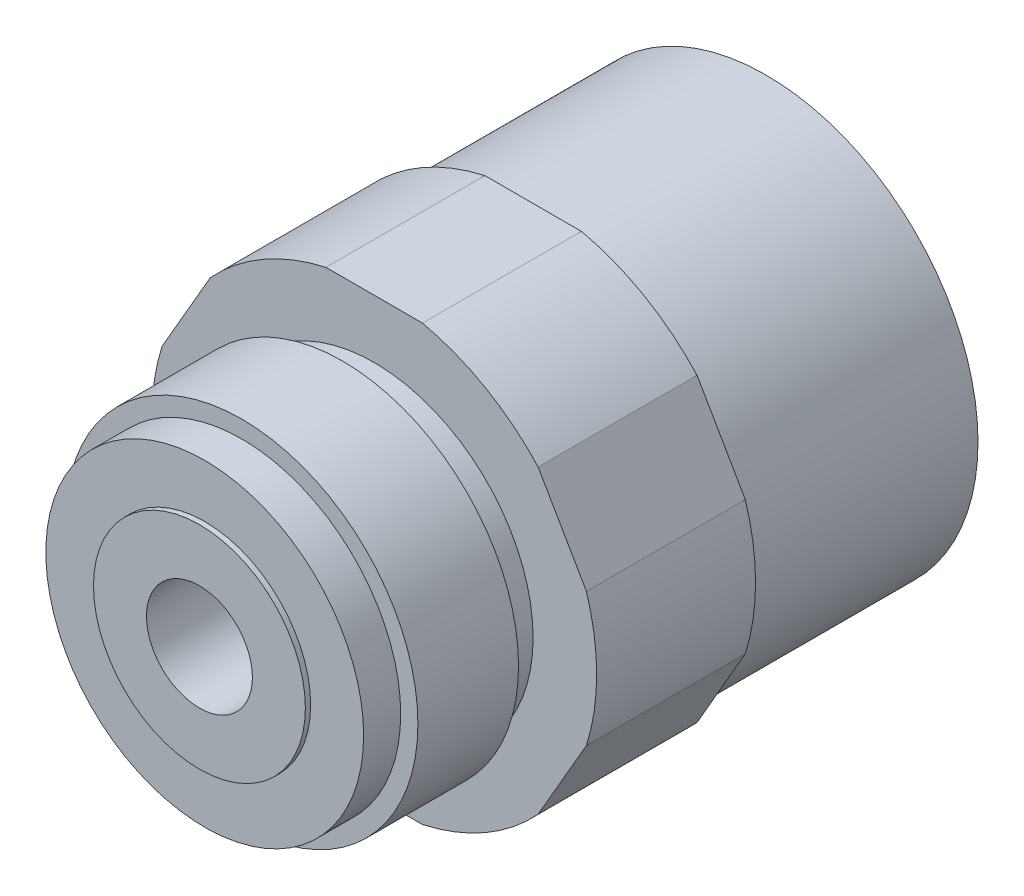
ISO-10303-21;
HEADER;
FILE_DESCRIPTION(('STEP AP214'),'2;1');
FILE_NAME('part.step','',(''),(''),'','','');
FILE_SCHEMA(('AUTOMOTIVE_DESIGN { 1 0 10303 214 1 1 1 1 }'));
ENDSEC;
DATA;
#1=APPLICATION_CONTEXT('core data for automotive mechanical design processes');
#2=APPLICATION_PROTOCOL_DEFINITION('international standard','automotive_design',2000,#1);
#3=PRODUCT_CONTEXT('',#1,'mechanical');
#4=PRODUCT('Part','Part','',(#3));
#5=PRODUCT_RELATED_PRODUCT_CATEGORY('part','',(#4));
#6=PRODUCT_DEFINITION_FORMATION('','',#4);
#7=PRODUCT_DEFINITION_CONTEXT('part definition',#1,'design');
#8=PRODUCT_DEFINITION('design','',#6,#7);
#9=PRODUCT_DEFINITION_SHAPE('','',#8);
#10=(LENGTH_UNIT() NAMED_UNIT(*) SI_UNIT(.MILLI.,.METRE.));
#11=(NAMED_UNIT(*) PLANE_ANGLE_UNIT() SI_UNIT($,.RADIAN.));
#12=(NAMED_UNIT(*) SI_UNIT($,.STERADIAN.) SOLID_ANGLE_UNIT());
#13=UNCERTAINTY_MEASURE_WITH_UNIT(LENGTH_MEASURE(1.E-05),#10,'distance_accuracy_value','');
#14=(GEOMETRIC_REPRESENTATION_CONTEXT(3) GLOBAL_UNCERTAINTY_ASSIGNED_CONTEXT((#13)) GLOBAL_UNIT_ASSIGNED_CONTEXT((#10,
#11,#12)) REPRESENTATION_CONTEXT('',''));
#15=CARTESIAN_POINT('',(0.,0.,0.));
#16=DIRECTION('',(0.,0.,1.));
#17=DIRECTION('',(1.,0.,0.));
#18=AXIS2_PLACEMENT_3D('',#15,#16,#17);
#19=CARTESIAN_POINT('',(0.,0.,-1072.5));
#20=DIRECTION('',(0.,0.,-1.));
#21=DIRECTION('',(-1.,0.,0.));
#22=AXIS2_PLACEMENT_3D('',#19,#20,#21);
#23=PLANE('',#22);
#24=CARTESIAN_POINT('',(0.,0.,-1072.5));
#25=DIRECTION('',(0.,0.,1.));
#26=DIRECTION('',(1.,0.,0.));
#27=AXIS2_PLACEMENT_3D('',#24,#25,#26);
#28=CIRCLE('',#27,15.);
#29=CARTESIAN_POINT('',(15.,0.,-1072.5));
#30=VERTEX_POINT('',#29);
#31=EDGE_CURVE('E191',#30,#30,#28,.T.);
#32=ORIENTED_EDGE('',*,*,#31,.F.);
#33=EDGE_LOOP('',(#32));
#34=FACE_BOUND('',#33,.T.);
#35=CARTESIAN_POINT('',(0.,0.,-1072.5));
#36=DIRECTION('',(0.,0.,-1.));
#37=DIRECTION('',(-1.,0.,0.));
#38=AXIS2_PLACEMENT_3D('',#35,#36,#37);
#39=CIRCLE('',#38,21.);
#40=CARTESIAN_POINT('',(-15.4759123827949,14.1949334595148,-1072.5));
#41=VERTEX_POINT('',#40);
#42=CARTESIAN_POINT('',(-4.55521678957215,20.5,-1072.5));
#43=VERTEX_POINT('',#42);
#44=EDGE_CURVE('E331',#41,#43,#39,.T.);
#45=ORIENTED_EDGE('',*,*,#44,.F.);
#46=DIRECTION('',(-0.5,-0.866025403784439,0.));
#47=VECTOR('',#46,1.);
#48=CARTESIAN_POINT('',(-11.8356805183873,20.5,-1072.5));
#49=LINE('',#48,#47);
#50=CARTESIAN_POINT('',(-20.0311291723671,6.30506654048513,-1072.5));
#51=VERTEX_POINT('',#50);
#52=EDGE_CURVE('E165',#41,#51,#49,.T.);
#53=ORIENTED_EDGE('',*,*,#52,.T.);
#54=CARTESIAN_POINT('',(-20.0311291723671,-6.30506654048513,-1072.5));
#55=VERTEX_POINT('',#54);
#56=EDGE_CURVE('E326',#55,#51,#39,.T.);
#57=ORIENTED_EDGE('',*,*,#56,.F.);
#58=DIRECTION('',(0.5,-0.866025403784438,0.));
#59=VECTOR('',#58,1.);
#60=CARTESIAN_POINT('',(-23.6713610367747,0.,-1072.5));
#61=LINE('',#60,#59);
#62=CARTESIAN_POINT('',(-15.4759123827949,-14.1949334595148,-1072.5));
#63=VERTEX_POINT('',#62);
#64=EDGE_CURVE('E169',#55,#63,#61,.T.);
#65=ORIENTED_EDGE('',*,*,#64,.T.);
#66=CARTESIAN_POINT('',(-4.55521678957211,-20.5,-1072.5));
#67=VERTEX_POINT('',#66);
#68=EDGE_CURVE('E315',#67,#63,#39,.T.);
#69=ORIENTED_EDGE('',*,*,#68,.F.);
#70=DIRECTION('',(1.,0.,0.));
#71=VECTOR('',#70,1.);
#72=CARTESIAN_POINT('',(-11.8356805183873,-20.5,-1072.5));
#73=LINE('',#72,#71);
#74=CARTESIAN_POINT('',(4.55521678957212,-20.5,-1072.5));
#75=VERTEX_POINT('',#74);
#76=EDGE_CURVE('E172',#67,#75,#73,.T.);
#77=ORIENTED_EDGE('',*,*,#76,.T.);
#78=CARTESIAN_POINT('',(15.4759123827949,-14.1949334595148,-1072.5));
#79=VERTEX_POINT('',#78);
#80=EDGE_CURVE('E307',#79,#75,#39,.T.);
#81=ORIENTED_EDGE('',*,*,#80,.F.);
#82=DIRECTION('',(0.5,0.866025403784439,0.));
#83=VECTOR('',#82,1.);
#84=CARTESIAN_POINT('',(11.8356805183873,-20.5,-1072.5));
#85=LINE('',#84,#83);
#86=CARTESIAN_POINT('',(20.0311291723671,-6.30506654048513,-1072.5));
#87=VERTEX_POINT('',#86);
#88=EDGE_CURVE('E175',#79,#87,#85,.T.);
#89=ORIENTED_EDGE('',*,*,#88,.T.);
#90=CARTESIAN_POINT('',(20.0311291723671,6.30506654048513,-1072.5));
#91=VERTEX_POINT('',#90);
#92=EDGE_CURVE('E147',#91,#87,#39,.T.);
#93=ORIENTED_EDGE('',*,*,#92,.F.);
#94=DIRECTION('',(-0.5,0.866025403784439,0.));
#95=VECTOR('',#94,1.);
#96=CARTESIAN_POINT('',(23.6713610367747,0.,-1072.5));
#97=LINE('',#96,#95);
#98=CARTESIAN_POINT('',(15.4759123827949,14.1949334595148,-1072.5));
#99=VERTEX_POINT('',#98);
#100=EDGE_CURVE('E146',#91,#99,#97,.T.);
#101=ORIENTED_EDGE('',*,*,#100,.T.);
#102=CARTESIAN_POINT('',(4.55521678957215,20.5,-1072.5));
#103=VERTEX_POINT('',#102);
#104=EDGE_CURVE('E166',#103,#99,#39,.T.);
#105=ORIENTED_EDGE('',*,*,#104,.F.);
#106=DIRECTION('',(-1.,0.,0.));
#107=VECTOR('',#106,1.);
#108=CARTESIAN_POINT('',(11.8356805183873,20.5,-1072.5));
#109=LINE('',#108,#107);
#110=EDGE_CURVE('E162',#103,#43,#109,.T.);
#111=ORIENTED_EDGE('',*,*,#110,.T.);
#112=EDGE_LOOP('',(#45,#53,#57,#65,#69,#77,#81,#89,#93,#101,#105,#111));
#113=FACE_BOUND('',#112,.T.);
#114=ADVANCED_FACE('F39',(#34,#113),#23,.F.);
#115=CARTESIAN_POINT('',(11.8356805183873,20.5,-1087.5));
#116=DIRECTION('',(0.,1.,0.));
#117=DIRECTION('',(0.,0.,1.));
#118=AXIS2_PLACEMENT_3D('',#115,#116,#117);
#119=PLANE('',#118);
#120=ORIENTED_EDGE('',*,*,#110,.F.);
#121=DIRECTION('',(0.,0.,-1.));
#122=VECTOR('',#121,1.);
#123=CARTESIAN_POINT('',(4.55521678957215,20.5,-1056.));
#124=LINE('',#123,#122);
#125=CARTESIAN_POINT('',(4.55521678957215,20.5,-1087.5));
#126=VERTEX_POINT('',#125);
#127=EDGE_CURVE('E339',#103,#126,#124,.T.);
#128=ORIENTED_EDGE('',*,*,#127,.T.);
#129=DIRECTION('',(-1.,0.,0.));
#130=VECTOR('',#129,1.);
#131=CARTESIAN_POINT('',(11.8356805183873,20.5,-1087.5));
#132=LINE('',#131,#130);
#133=CARTESIAN_POINT('',(-4.55521678957215,20.5,-1087.5));
#134=VERTEX_POINT('',#133);
#135=EDGE_CURVE('E178',#126,#134,#132,.T.);
#136=ORIENTED_EDGE('',*,*,#135,.T.);
#137=DIRECTION('',(0.,0.,-1.));
#138=VECTOR('',#137,1.);
#139=CARTESIAN_POINT('',(-4.55521678957215,20.5,-1056.));
#140=LINE('',#139,#138);
#141=EDGE_CURVE('E333',#134,#43,#140,.F.);
#142=ORIENTED_EDGE('',*,*,#141,.T.);
#143=EDGE_LOOP('',(#120,#128,#136,#142));
#144=FACE_BOUND('',#143,.T.);
#145=ADVANCED_FACE('F239',(#144),#119,.T.);
#146=CARTESIAN_POINT('',(23.6713610367747,0.,-1087.5));
#147=DIRECTION('',(0.866025403784439,0.5,0.));
#148=DIRECTION('',(-0.5,0.866025403784439,0.));
#149=AXIS2_PLACEMENT_3D('',#146,#147,#148);
#150=PLANE('',#149);
#151=ORIENTED_EDGE('',*,*,#100,.F.);
#152=DIRECTION('',(0.,0.,-1.));
#153=VECTOR('',#152,1.);
#154=CARTESIAN_POINT('',(20.0311291723671,6.30506654048513,-1056.));
#155=LINE('',#154,#153);
#156=CARTESIAN_POINT('',(20.0311291723671,6.30506654048513,-1087.5));
#157=VERTEX_POINT('',#156);
#158=EDGE_CURVE('E129',#91,#157,#155,.T.);
#159=ORIENTED_EDGE('',*,*,#158,.T.);
#160=DIRECTION('',(-0.5,0.866025403784439,0.));
#161=VECTOR('',#160,1.);
#162=CARTESIAN_POINT('',(23.6713610367747,0.,-1087.5));
#163=LINE('',#162,#161);
#164=CARTESIAN_POINT('',(15.4759123827949,14.1949334595148,-1087.5));
#165=VERTEX_POINT('',#164);
#166=EDGE_CURVE('E144',#157,#165,#163,.T.);
#167=ORIENTED_EDGE('',*,*,#166,.T.);
#168=DIRECTION('',(0.,0.,-1.));
#169=VECTOR('',#168,1.);
#170=CARTESIAN_POINT('',(15.4759123827949,14.1949334595148,-1056.));
#171=LINE('',#170,#169);
#172=EDGE_CURVE('E337',#165,#99,#171,.F.);
#173=ORIENTED_EDGE('',*,*,#172,.T.);
#174=EDGE_LOOP('',(#151,#159,#167,#173));
#175=FACE_BOUND('',#174,.T.);
#176=ADVANCED_FACE('F142',(#175),#150,.T.);
#177=CARTESIAN_POINT('',(11.8356805183873,-20.5,-1087.5));
#178=DIRECTION('',(0.866025403784439,-0.5,0.));
#179=DIRECTION('',(0.5,0.866025403784439,0.));
#180=AXIS2_PLACEMENT_3D('',#177,#178,#179);
#181=PLANE('',#180);
#182=ORIENTED_EDGE('',*,*,#88,.F.);
#183=DIRECTION('',(0.,0.,-1.));
#184=VECTOR('',#183,1.);
#185=CARTESIAN_POINT('',(15.4759123827949,-14.1949334595148,-1056.));
#186=LINE('',#185,#184);
#187=CARTESIAN_POINT('',(15.4759123827949,-14.1949334595148,-1087.5));
#188=VERTEX_POINT('',#187);
#189=EDGE_CURVE('E312',#79,#188,#186,.T.);
#190=ORIENTED_EDGE('',*,*,#189,.T.);
#191=DIRECTION('',(0.5,0.866025403784439,0.));
#192=VECTOR('',#191,1.);
#193=CARTESIAN_POINT('',(11.8356805183873,-20.5,-1087.5));
#194=LINE('',#193,#192);
#195=CARTESIAN_POINT('',(20.0311291723671,-6.30506654048513,-1087.5));
#196=VERTEX_POINT('',#195);
#197=EDGE_CURVE('E153',#188,#196,#194,.T.);
#198=ORIENTED_EDGE('',*,*,#197,.T.);
#199=DIRECTION('',(0.,0.,-1.));
#200=VECTOR('',#199,1.);
#201=CARTESIAN_POINT('',(20.0311291723671,-6.30506654048513,-1056.));
#202=LINE('',#201,#200);
#203=EDGE_CURVE('E132',#196,#87,#202,.F.);
#204=ORIENTED_EDGE('',*,*,#203,.T.);
#205=EDGE_LOOP('',(#182,#190,#198,#204));
#206=FACE_BOUND('',#205,.T.);
#207=ADVANCED_FACE('F280',(#206),#181,.T.);
#208=CARTESIAN_POINT('',(-11.8356805183873,-20.5,-1087.5));
#209=DIRECTION('',(0.,-1.,0.));
#210=DIRECTION('',(1.,0.,0.));
#211=AXIS2_PLACEMENT_3D('',#208,#209,#210);
#212=PLANE('',#211);
#213=ORIENTED_EDGE('',*,*,#76,.F.);
#214=DIRECTION('',(0.,0.,-1.));
#215=VECTOR('',#214,1.);
#216=CARTESIAN_POINT('',(-4.55521678957211,-20.5,-1056.));
#217=LINE('',#216,#215);
#218=CARTESIAN_POINT('',(-4.55521678957211,-20.5,-1087.5));
#219=VERTEX_POINT('',#218);
#220=EDGE_CURVE('E325',#67,#219,#217,.T.);
#221=ORIENTED_EDGE('',*,*,#220,.T.);
#222=DIRECTION('',(1.,0.,0.));
#223=VECTOR('',#222,1.);
#224=CARTESIAN_POINT('',(-11.8356805183873,-20.5,-1087.5));
#225=LINE('',#224,#223);
#226=CARTESIAN_POINT('',(4.55521678957212,-20.5,-1087.5));
#227=VERTEX_POINT('',#226);
#228=EDGE_CURVE('E158',#219,#227,#225,.T.);
#229=ORIENTED_EDGE('',*,*,#228,.T.);
#230=DIRECTION('',(0.,0.,-1.));
#231=VECTOR('',#230,1.);
#232=CARTESIAN_POINT('',(4.55521678957212,-20.5,-1056.));
#233=LINE('',#232,#231);
#234=EDGE_CURVE('E309',#227,#75,#233,.F.);
#235=ORIENTED_EDGE('',*,*,#234,.T.);
#236=EDGE_LOOP('',(#213,#221,#229,#235));
#237=FACE_BOUND('',#236,.T.);
#238=ADVANCED_FACE('F276',(#237),#212,.T.);
#239=CARTESIAN_POINT('',(-23.6713610367747,0.,-1087.5));
#240=DIRECTION('',(-0.866025403784439,-0.5,0.));
#241=DIRECTION('',(0.5,-0.866025403784439,0.));
#242=AXIS2_PLACEMENT_3D('',#239,#240,#241);
#243=PLANE('',#242);
#244=ORIENTED_EDGE('',*,*,#64,.F.);
#245=DIRECTION('',(0.,0.,-1.));
#246=VECTOR('',#245,1.);
#247=CARTESIAN_POINT('',(-20.0311291723671,-6.30506654048513,-1056.));
#248=LINE('',#247,#246);
#249=CARTESIAN_POINT('',(-20.0311291723671,-6.30506654048513,-1087.5));
#250=VERTEX_POINT('',#249);
#251=EDGE_CURVE('E327',#55,#250,#248,.T.);
#252=ORIENTED_EDGE('',*,*,#251,.T.);
#253=DIRECTION('',(0.5,-0.866025403784438,0.));
#254=VECTOR('',#253,1.);
#255=CARTESIAN_POINT('',(-23.6713610367747,0.,-1087.5));
#256=LINE('',#255,#254);
#257=CARTESIAN_POINT('',(-15.4759123827949,-14.1949334595148,-1087.5));
#258=VERTEX_POINT('',#257);
#259=EDGE_CURVE('E355',#250,#258,#256,.T.);
#260=ORIENTED_EDGE('',*,*,#259,.T.);
#261=DIRECTION('',(0.,0.,-1.));
#262=VECTOR('',#261,1.);
#263=CARTESIAN_POINT('',(-15.4759123827949,-14.1949334595148,-1056.));
#264=LINE('',#263,#262);
#265=EDGE_CURVE('E63',#258,#63,#264,.F.);
#266=ORIENTED_EDGE('',*,*,#265,.T.);
#267=EDGE_LOOP('',(#244,#252,#260,#266));
#268=FACE_BOUND('',#267,.T.);
#269=ADVANCED_FACE('F272',(#268),#243,.T.);
#270=CARTESIAN_POINT('',(-11.8356805183873,20.5,-1087.5));
#271=DIRECTION('',(-0.866025403784439,0.5,0.));
#272=DIRECTION('',(-0.5,-0.866025403784439,0.));
#273=AXIS2_PLACEMENT_3D('',#270,#271,#272);
#274=PLANE('',#273);
#275=ORIENTED_EDGE('',*,*,#52,.F.);
#276=DIRECTION('',(0.,0.,-1.));
#277=VECTOR('',#276,1.);
#278=CARTESIAN_POINT('',(-15.4759123827949,14.1949334595148,-1056.));
#279=LINE('',#278,#277);
#280=CARTESIAN_POINT('',(-15.4759123827949,14.1949334595148,-1087.5));
#281=VERTEX_POINT('',#280);
#282=EDGE_CURVE('E330',#41,#281,#279,.T.);
#283=ORIENTED_EDGE('',*,*,#282,.T.);
#284=DIRECTION('',(-0.5,-0.866025403784439,0.));
#285=VECTOR('',#284,1.);
#286=CARTESIAN_POINT('',(-11.8356805183873,20.5,-1087.5));
#287=LINE('',#286,#285);
#288=CARTESIAN_POINT('',(-20.0311291723671,6.30506654048513,-1087.5));
#289=VERTEX_POINT('',#288);
#290=EDGE_CURVE('E353',#281,#289,#287,.T.);
#291=ORIENTED_EDGE('',*,*,#290,.T.);
#292=DIRECTION('',(0.,0.,-1.));
#293=VECTOR('',#292,1.);
#294=CARTESIAN_POINT('',(-20.0311291723671,6.30506654048513,-1056.));
#295=LINE('',#294,#293);
#296=EDGE_CURVE('E55',#289,#51,#295,.F.);
#297=ORIENTED_EDGE('',*,*,#296,.T.);
#298=EDGE_LOOP('',(#275,#283,#291,#297));
#299=FACE_BOUND('',#298,.T.);
#300=ADVANCED_FACE('F234',(#299),#274,.T.);
#301=CARTESIAN_POINT('',(0.,0.,-1087.5));
#302=DIRECTION('',(0.,0.,1.));
#303=DIRECTION('',(1.,0.,0.));
#304=AXIS2_PLACEMENT_3D('',#301,#302,#303);
#305=PLANE('',#304);
#306=CARTESIAN_POINT('',(0.,0.,-1087.5));
#307=DIRECTION('',(0.,0.,1.));
#308=DIRECTION('',(1.,0.,0.));
#309=AXIS2_PLACEMENT_3D('',#306,#307,#308);
#310=CIRCLE('',#309,20.);
#311=CARTESIAN_POINT('',(20.,0.,-1087.5));
#312=VERTEX_POINT('',#311);
#313=EDGE_CURVE('E138',#312,#312,#310,.T.);
#314=ORIENTED_EDGE('',*,*,#313,.T.);
#315=EDGE_LOOP('',(#314));
#316=FACE_BOUND('',#315,.T.);
#317=CARTESIAN_POINT('',(0.,0.,-1087.5));
#318=DIRECTION('',(0.,0.,1.));
#319=DIRECTION('',(1.,0.,0.));
#320=AXIS2_PLACEMENT_3D('',#317,#318,#319);
#321=CIRCLE('',#320,21.);
#322=EDGE_CURVE('E11',#165,#126,#321,.T.);
#323=ORIENTED_EDGE('',*,*,#322,.F.);
#324=ORIENTED_EDGE('',*,*,#166,.F.);
#325=EDGE_CURVE('E43',#196,#157,#321,.T.);
#326=ORIENTED_EDGE('',*,*,#325,.F.);
#327=ORIENTED_EDGE('',*,*,#197,.F.);
#328=EDGE_CURVE('E137',#227,#188,#321,.T.);
#329=ORIENTED_EDGE('',*,*,#328,.F.);
#330=ORIENTED_EDGE('',*,*,#228,.F.);
#331=EDGE_CURVE('E346',#258,#219,#321,.T.);
#332=ORIENTED_EDGE('',*,*,#331,.F.);
#333=ORIENTED_EDGE('',*,*,#259,.F.);
#334=EDGE_CURVE('E347',#289,#250,#321,.T.);
#335=ORIENTED_EDGE('',*,*,#334,.F.);
#336=ORIENTED_EDGE('',*,*,#290,.F.);
#337=EDGE_CURVE('E48',#134,#281,#321,.T.);
#338=ORIENTED_EDGE('',*,*,#337,.F.);
#339=ORIENTED_EDGE('',*,*,#135,.F.);
#340=EDGE_LOOP('',(#323,#324,#326,#327,#329,#330,#332,#333,#335,#336,#338,#339));
#341=FACE_BOUND('',#340,.T.);
#342=ADVANCED_FACE('F150',(#316,#341),#305,.F.);
#343=CARTESIAN_POINT('',(0.,0.,0.));
#344=DIRECTION('',(0.,0.,1.));
#345=DIRECTION('',(1.,0.,0.));
#346=AXIS2_PLACEMENT_3D('',#343,#344,#345);
#347=CYLINDRICAL_SURFACE('',#346,20.);
#348=CARTESIAN_POINT('',(0.,0.,-1109.5));
#349=DIRECTION('',(0.,0.,1.));
#350=DIRECTION('',(1.,0.,0.));
#351=AXIS2_PLACEMENT_3D('',#348,#349,#350);
#352=CIRCLE('',#351,20.);
#353=CARTESIAN_POINT('',(20.,0.,-1109.5));
#354=VERTEX_POINT('',#353);
#355=EDGE_CURVE('E194',#354,#354,#352,.T.);
#356=ORIENTED_EDGE('',*,*,#355,.T.);
#357=EDGE_LOOP('',(#356));
#358=FACE_BOUND('',#357,.T.);
#359=ORIENTED_EDGE('',*,*,#313,.F.);
#360=EDGE_LOOP('',(#359));
#361=FACE_BOUND('',#360,.T.);
#362=ADVANCED_FACE('F224',(#358,#361),#347,.T.);
#363=CARTESIAN_POINT('',(0.,0.,-1056.5));
#364=DIRECTION('',(0.,0.,1.));
#365=DIRECTION('',(1.,0.,0.));
#366=AXIS2_PLACEMENT_3D('',#363,#364,#365);
#367=PLANE('',#366);
#368=CARTESIAN_POINT('',(0.,0.,-1056.5));
#369=DIRECTION('',(0.,0.,1.));
#370=DIRECTION('',(1.,0.,0.));
#371=AXIS2_PLACEMENT_3D('',#368,#369,#370);
#372=CIRCLE('',#371,15.);
#373=CARTESIAN_POINT('',(15.,0.,-1056.5));
#374=VERTEX_POINT('',#373);
#375=EDGE_CURVE('E152',#374,#374,#372,.T.);
#376=ORIENTED_EDGE('',*,*,#375,.T.);
#377=EDGE_LOOP('',(#376));
#378=FACE_BOUND('',#377,.T.);
#379=CARTESIAN_POINT('',(0.,0.,-1056.5));
#380=DIRECTION('',(0.,0.,1.));
#381=DIRECTION('',(1.,0.,0.));
#382=AXIS2_PLACEMENT_3D('',#379,#380,#381);
#383=CIRCLE('',#382,10.);
#384=CARTESIAN_POINT('',(10.,0.,-1056.5));
#385=VERTEX_POINT('',#384);
#386=EDGE_CURVE('E218',#385,#385,#383,.T.);
#387=ORIENTED_EDGE('',*,*,#386,.F.);
#388=EDGE_LOOP('',(#387));
#389=FACE_BOUND('',#388,.T.);
#390=ADVANCED_FACE('F41',(#378,#389),#367,.T.);
#391=CARTESIAN_POINT('',(0.,0.,0.));
#392=DIRECTION('',(0.,0.,1.));
#393=DIRECTION('',(1.,0.,0.));
#394=AXIS2_PLACEMENT_3D('',#391,#392,#393);
#395=CYLINDRICAL_SURFACE('',#394,10.);
#396=ORIENTED_EDGE('',*,*,#386,.T.);
#397=EDGE_LOOP('',(#396));
#398=FACE_BOUND('',#397,.T.);
#399=CARTESIAN_POINT('',(0.,0.,-1056.));
#400=DIRECTION('',(0.,0.,1.));
#401=DIRECTION('',(1.,0.,0.));
#402=AXIS2_PLACEMENT_3D('',#399,#400,#401);
#403=CIRCLE('',#402,10.);
#404=CARTESIAN_POINT('',(10.,0.,-1056.));
#405=VERTEX_POINT('',#404);
#406=EDGE_CURVE('E215',#405,#405,#403,.T.);
#407=ORIENTED_EDGE('',*,*,#406,.F.);
#408=EDGE_LOOP('',(#407));
#409=FACE_BOUND('',#408,.T.);
#410=ADVANCED_FACE('F232',(#398,#409),#395,.T.);
#411=CARTESIAN_POINT('',(0.,0.,-1056.));
#412=DIRECTION('',(0.,0.,-1.));
#413=DIRECTION('',(-1.,0.,0.));
#414=AXIS2_PLACEMENT_3D('',#411,#412,#413);
#415=PLANE('',#414);
#416=CARTESIAN_POINT('',(0.,0.,-1056.));
#417=DIRECTION('',(0.,0.,1.));
#418=DIRECTION('',(1.,0.,0.));
#419=AXIS2_PLACEMENT_3D('',#416,#417,#418);
#420=CIRCLE('',#419,5.);
#421=CARTESIAN_POINT('',(5.,0.,-1056.));
#422=VERTEX_POINT('',#421);
#423=EDGE_CURVE('E212',#422,#422,#420,.T.);
#424=ORIENTED_EDGE('',*,*,#423,.F.);
#425=EDGE_LOOP('',(#424));
#426=FACE_BOUND('',#425,.T.);
#427=ORIENTED_EDGE('',*,*,#406,.T.);
#428=EDGE_LOOP('',(#427));
#429=FACE_BOUND('',#428,.T.);
#430=ADVANCED_FACE('F481',(#426,#429),#415,.F.);
#431=CARTESIAN_POINT('',(0.,0.,0.));
#432=DIRECTION('',(0.,0.,1.));
#433=DIRECTION('',(1.,0.,0.));
#434=AXIS2_PLACEMENT_3D('',#431,#432,#433);
#435=CYLINDRICAL_SURFACE('',#434,5.);
#436=CARTESIAN_POINT('',(0.,0.,-1092.5));
#437=DIRECTION('',(0.,0.,1.));
#438=DIRECTION('',(1.,0.,0.));
#439=AXIS2_PLACEMENT_3D('',#436,#437,#438);
#440=CIRCLE('',#439,5.);
#441=CARTESIAN_POINT('',(5.,0.,-1092.5));
#442=VERTEX_POINT('',#441);
#443=EDGE_CURVE('E209',#442,#442,#440,.T.);
#444=ORIENTED_EDGE('',*,*,#443,.F.);
#445=EDGE_LOOP('',(#444));
#446=FACE_BOUND('',#445,.T.);
#447=ORIENTED_EDGE('',*,*,#423,.T.);
#448=EDGE_LOOP('',(#447));
#449=FACE_BOUND('',#448,.T.);
#450=ADVANCED_FACE('F473',(#446,#449),#435,.F.);
#451=CARTESIAN_POINT('',(0.,0.,-1092.5));
#452=DIRECTION('',(0.,0.,1.));
#453=DIRECTION('',(1.,0.,0.));
#454=AXIS2_PLACEMENT_3D('',#451,#452,#453);
#455=PLANE('',#454);
#456=CARTESIAN_POINT('',(0.,0.,-1092.5));
#457=DIRECTION('',(0.,0.,1.));
#458=DIRECTION('',(1.,0.,0.));
#459=AXIS2_PLACEMENT_3D('',#456,#457,#458);
#460=CIRCLE('',#459,13.5);
#461=CARTESIAN_POINT('',(13.5,0.,-1092.5));
#462=VERTEX_POINT('',#461);
#463=EDGE_CURVE('E206',#462,#462,#460,.T.);
#464=ORIENTED_EDGE('',*,*,#463,.F.);
#465=EDGE_LOOP('',(#464));
#466=FACE_BOUND('',#465,.T.);
#467=ORIENTED_EDGE('',*,*,#443,.T.);
#468=EDGE_LOOP('',(#467));
#469=FACE_BOUND('',#468,.T.);
#470=ADVANCED_FACE('F465',(#466,#469),#455,.F.);
#471=CARTESIAN_POINT('',(0.,0.,0.));
#472=DIRECTION('',(0.,0.,1.));
#473=DIRECTION('',(1.,0.,0.));
#474=AXIS2_PLACEMENT_3D('',#471,#472,#473);
#475=CYLINDRICAL_SURFACE('',#474,13.5);
#476=CARTESIAN_POINT('',(0.,0.,-1095.5));
#477=DIRECTION('',(0.,0.,1.));
#478=DIRECTION('',(1.,0.,0.));
#479=AXIS2_PLACEMENT_3D('',#476,#477,#478);
#480=CIRCLE('',#479,13.5);
#481=CARTESIAN_POINT('',(13.5,0.,-1095.5));
#482=VERTEX_POINT('',#481);
#483=EDGE_CURVE('E203',#482,#482,#480,.T.);
#484=ORIENTED_EDGE('',*,*,#483,.F.);
#485=EDGE_LOOP('',(#484));
#486=FACE_BOUND('',#485,.T.);
#487=ORIENTED_EDGE('',*,*,#463,.T.);
#488=EDGE_LOOP('',(#487));
#489=FACE_BOUND('',#488,.T.);
#490=ADVANCED_FACE('F457',(#486,#489),#475,.F.);
#491=CARTESIAN_POINT('',(0.,0.,-1095.5));
#492=DIRECTION('',(0.,0.,-1.));
#493=DIRECTION('',(-1.,0.,0.));
#494=AXIS2_PLACEMENT_3D('',#491,#492,#493);
#495=PLANE('',#494);
#496=CARTESIAN_POINT('',(0.,0.,-1095.5));
#497=DIRECTION('',(0.,0.,1.));
#498=DIRECTION('',(1.,0.,0.));
#499=AXIS2_PLACEMENT_3D('',#496,#497,#498);
#500=CIRCLE('',#499,12.25);
#501=CARTESIAN_POINT('',(12.25,0.,-1095.5));
#502=VERTEX_POINT('',#501);
#503=EDGE_CURVE('E200',#502,#502,#500,.T.);
#504=ORIENTED_EDGE('',*,*,#503,.F.);
#505=EDGE_LOOP('',(#504));
#506=FACE_BOUND('',#505,.T.);
#507=ORIENTED_EDGE('',*,*,#483,.T.);
#508=EDGE_LOOP('',(#507));
#509=FACE_BOUND('',#508,.T.);
#510=ADVANCED_FACE('F449',(#506,#509),#495,.F.);
#511=CARTESIAN_POINT('',(0.,0.,0.));
#512=DIRECTION('',(0.,0.,1.));
#513=DIRECTION('',(1.,0.,0.));
#514=AXIS2_PLACEMENT_3D('',#511,#512,#513);
#515=CYLINDRICAL_SURFACE('',#514,12.25);
#516=CARTESIAN_POINT('',(0.,0.,-1109.5));
#517=DIRECTION('',(0.,0.,1.));
#518=DIRECTION('',(1.,0.,0.));
#519=AXIS2_PLACEMENT_3D('',#516,#517,#518);
#520=CIRCLE('',#519,12.25);
#521=CARTESIAN_POINT('',(12.25,0.,-1109.5));
#522=VERTEX_POINT('',#521);
#523=EDGE_CURVE('E197',#522,#522,#520,.T.);
#524=ORIENTED_EDGE('',*,*,#523,.F.);
#525=EDGE_LOOP('',(#524));
#526=FACE_BOUND('',#525,.T.);
#527=ORIENTED_EDGE('',*,*,#503,.T.);
#528=EDGE_LOOP('',(#527));
#529=FACE_BOUND('',#528,.T.);
#530=ADVANCED_FACE('F442',(#526,#529),#515,.F.);
#531=CARTESIAN_POINT('',(0.,0.,-1109.5));
#532=DIRECTION('',(0.,0.,1.));
#533=DIRECTION('',(1.,0.,0.));
#534=AXIS2_PLACEMENT_3D('',#531,#532,#533);
#535=PLANE('',#534);
#536=ORIENTED_EDGE('',*,*,#355,.F.);
#537=EDGE_LOOP('',(#536));
#538=FACE_BOUND('',#537,.T.);
#539=ORIENTED_EDGE('',*,*,#523,.T.);
#540=EDGE_LOOP('',(#539));
#541=FACE_BOUND('',#540,.T.);
#542=ADVANCED_FACE('F253',(#538,#541),#535,.F.);
#543=CARTESIAN_POINT('',(0.,0.,0.));
#544=DIRECTION('',(0.,0.,1.));
#545=DIRECTION('',(1.,0.,0.));
#546=AXIS2_PLACEMENT_3D('',#543,#544,#545);
#547=CYLINDRICAL_SURFACE('',#546,15.);
#548=ORIENTED_EDGE('',*,*,#31,.T.);
#549=EDGE_LOOP('',(#548));
#550=FACE_BOUND('',#549,.T.);
#551=CARTESIAN_POINT('',(0.,0.,-1069.5));
#552=DIRECTION('',(0.,0.,1.));
#553=DIRECTION('',(1.,0.,0.));
#554=AXIS2_PLACEMENT_3D('',#551,#552,#553);
#555=CIRCLE('',#554,15.);
#556=CARTESIAN_POINT('',(15.,0.,-1069.5));
#557=VERTEX_POINT('',#556);
#558=EDGE_CURVE('E188',#557,#557,#555,.T.);
#559=ORIENTED_EDGE('',*,*,#558,.F.);
#560=EDGE_LOOP('',(#559));
#561=FACE_BOUND('',#560,.T.);
#562=ADVANCED_FACE('F249',(#550,#561),#547,.T.);
#563=CARTESIAN_POINT('',(0.,0.,-1069.5));
#564=DIRECTION('',(0.,0.,-1.));
#565=DIRECTION('',(-1.,0.,0.));
#566=AXIS2_PLACEMENT_3D('',#563,#564,#565);
#567=PLANE('',#566);
#568=ORIENTED_EDGE('',*,*,#558,.T.);
#569=EDGE_LOOP('',(#568));
#570=FACE_BOUND('',#569,.T.);
#571=CARTESIAN_POINT('',(0.,0.,-1069.5));
#572=DIRECTION('',(0.,0.,1.));
#573=DIRECTION('',(1.,0.,0.));
#574=AXIS2_PLACEMENT_3D('',#571,#572,#573);
#575=CIRCLE('',#574,16.625);
#576=CARTESIAN_POINT('',(16.625,0.,-1069.5));
#577=VERTEX_POINT('',#576);
#578=EDGE_CURVE('E185',#577,#577,#575,.T.);
#579=ORIENTED_EDGE('',*,*,#578,.F.);
#580=EDGE_LOOP('',(#579));
#581=FACE_BOUND('',#580,.T.);
#582=ADVANCED_FACE('F252',(#570,#581),#567,.T.);
#583=CARTESIAN_POINT('',(0.,0.,0.));
#584=DIRECTION('',(0.,0.,1.));
#585=DIRECTION('',(1.,0.,0.));
#586=AXIS2_PLACEMENT_3D('',#583,#584,#585);
#587=CYLINDRICAL_SURFACE('',#586,16.625);
#588=ORIENTED_EDGE('',*,*,#578,.T.);
#589=EDGE_LOOP('',(#588));
#590=FACE_BOUND('',#589,.T.);
#591=CARTESIAN_POINT('',(0.,0.,-1060.));
#592=DIRECTION('',(0.,0.,1.));
#593=DIRECTION('',(1.,0.,0.));
#594=AXIS2_PLACEMENT_3D('',#591,#592,#593);
#595=CIRCLE('',#594,16.625);
#596=CARTESIAN_POINT('',(16.625,0.,-1060.));
#597=VERTEX_POINT('',#596);
#598=EDGE_CURVE('E182',#597,#597,#595,.T.);
#599=ORIENTED_EDGE('',*,*,#598,.F.);
#600=EDGE_LOOP('',(#599));
#601=FACE_BOUND('',#600,.T.);
#602=ADVANCED_FACE('F257',(#590,#601),#587,.T.);
#603=CARTESIAN_POINT('',(0.,0.,-1060.));
#604=DIRECTION('',(0.,0.,1.));
#605=DIRECTION('',(1.,0.,0.));
#606=AXIS2_PLACEMENT_3D('',#603,#604,#605);
#607=PLANE('',#606);
#608=ORIENTED_EDGE('',*,*,#598,.T.);
#609=EDGE_LOOP('',(#608));
#610=FACE_BOUND('',#609,.T.);
#611=CARTESIAN_POINT('',(0.,0.,-1060.));
#612=DIRECTION('',(0.,0.,1.));
#613=DIRECTION('',(1.,0.,0.));
#614=AXIS2_PLACEMENT_3D('',#611,#612,#613);
#615=CIRCLE('',#614,15.);
#616=CARTESIAN_POINT('',(15.,0.,-1060.));
#617=VERTEX_POINT('',#616);
#618=EDGE_CURVE('E156',#617,#617,#615,.T.);
#619=ORIENTED_EDGE('',*,*,#618,.F.);
#620=EDGE_LOOP('',(#619));
#621=FACE_BOUND('',#620,.T.);
#622=ADVANCED_FACE('F261',(#610,#621),#607,.T.);
#623=CARTESIAN_POINT('',(0.,0.,0.));
#624=DIRECTION('',(0.,0.,1.));
#625=DIRECTION('',(1.,0.,0.));
#626=AXIS2_PLACEMENT_3D('',#623,#624,#625);
#627=CYLINDRICAL_SURFACE('',#626,15.);
#628=ORIENTED_EDGE('',*,*,#618,.T.);
#629=EDGE_LOOP('',(#628));
#630=FACE_BOUND('',#629,.T.);
#631=ORIENTED_EDGE('',*,*,#375,.F.);
#632=EDGE_LOOP('',(#631));
#633=FACE_BOUND('',#632,.T.);
#634=ADVANCED_FACE('F265',(#630,#633),#627,.T.);
#635=CARTESIAN_POINT('',(0.,0.,-1056.));
#636=DIRECTION('',(0.,0.,-1.));
#637=DIRECTION('',(-1.,0.,0.));
#638=AXIS2_PLACEMENT_3D('',#635,#636,#637);
#639=CYLINDRICAL_SURFACE('',#638,21.);
#640=ORIENTED_EDGE('',*,*,#92,.T.);
#641=ORIENTED_EDGE('',*,*,#203,.F.);
#642=ORIENTED_EDGE('',*,*,#325,.T.);
#643=ORIENTED_EDGE('',*,*,#158,.F.);
#644=EDGE_LOOP('',(#640,#641,#642,#643));
#645=FACE_BOUND('',#644,.T.);
#646=ADVANCED_FACE('F128',(#645),#639,.T.);
#647=ORIENTED_EDGE('',*,*,#80,.T.);
#648=ORIENTED_EDGE('',*,*,#234,.F.);
#649=ORIENTED_EDGE('',*,*,#328,.T.);
#650=ORIENTED_EDGE('',*,*,#189,.F.);
#651=EDGE_LOOP('',(#647,#648,#649,#650));
#652=FACE_BOUND('',#651,.T.);
#653=ADVANCED_FACE('F297',(#652),#639,.T.);
#654=ORIENTED_EDGE('',*,*,#68,.T.);
#655=ORIENTED_EDGE('',*,*,#265,.F.);
#656=ORIENTED_EDGE('',*,*,#331,.T.);
#657=ORIENTED_EDGE('',*,*,#220,.F.);
#658=EDGE_LOOP('',(#654,#655,#656,#657));
#659=FACE_BOUND('',#658,.T.);
#660=ADVANCED_FACE('F301',(#659),#639,.T.);
#661=ORIENTED_EDGE('',*,*,#56,.T.);
#662=ORIENTED_EDGE('',*,*,#296,.F.);
#663=ORIENTED_EDGE('',*,*,#334,.T.);
#664=ORIENTED_EDGE('',*,*,#251,.F.);
#665=EDGE_LOOP('',(#661,#662,#663,#664));
#666=FACE_BOUND('',#665,.T.);
#667=ADVANCED_FACE('F294',(#666),#639,.T.);
#668=ORIENTED_EDGE('',*,*,#44,.T.);
#669=ORIENTED_EDGE('',*,*,#141,.F.);
#670=ORIENTED_EDGE('',*,*,#337,.T.);
#671=ORIENTED_EDGE('',*,*,#282,.F.);
#672=EDGE_LOOP('',(#668,#669,#670,#671));
#673=FACE_BOUND('',#672,.T.);
#674=ADVANCED_FACE('F289',(#673),#639,.T.);
#675=ORIENTED_EDGE('',*,*,#104,.T.);
#676=ORIENTED_EDGE('',*,*,#172,.F.);
#677=ORIENTED_EDGE('',*,*,#322,.T.);
#678=ORIENTED_EDGE('',*,*,#127,.F.);
#679=EDGE_LOOP('',(#675,#676,#677,#678));
#680=FACE_BOUND('',#679,.T.);
#681=ADVANCED_FACE('F287',(#680),#639,.T.);
#682=CLOSED_SHELL('',(#114,#145,#176,#207,#238,#269,#300,#342,#362,#390,#410,#430,#450,#470,
#490,#510,#530,#542,#562,#582,#602,#622,#634,#646,#653,#660,#667,#674,#681));
#683=MANIFOLD_SOLID_BREP('B2',#682);
#684=ADVANCED_BREP_SHAPE_REPRESENTATION('',(#18,#683),#14);
#685=SHAPE_DEFINITION_REPRESENTATION(#9,#684);
ENDSEC;
END-ISO-10303-21;
